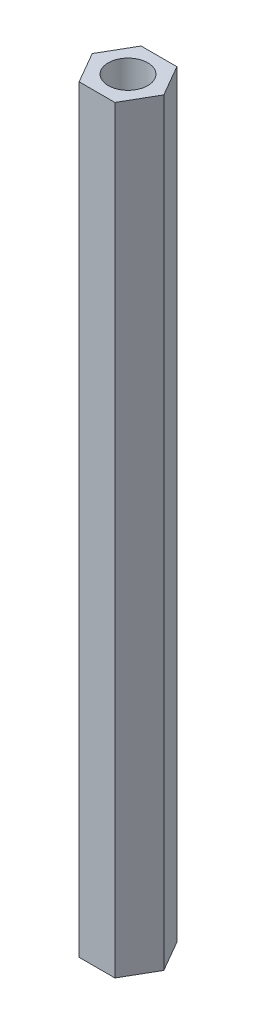
ISO-10303-21;
HEADER;
FILE_DESCRIPTION(('STEP AP214'),'2;1');
FILE_NAME('part.step','',(''),(''),'','','');
FILE_SCHEMA(('AUTOMOTIVE_DESIGN { 1 0 10303 214 1 1 1 1 }'));
ENDSEC;
DATA;
#1=APPLICATION_CONTEXT('core data for automotive mechanical design processes');
#2=APPLICATION_PROTOCOL_DEFINITION('international standard','automotive_design',2000,#1);
#3=PRODUCT_CONTEXT('',#1,'mechanical');
#4=PRODUCT('Part','Part','',(#3));
#5=PRODUCT_RELATED_PRODUCT_CATEGORY('part','',(#4));
#6=PRODUCT_DEFINITION_FORMATION('','',#4);
#7=PRODUCT_DEFINITION_CONTEXT('part definition',#1,'design');
#8=PRODUCT_DEFINITION('design','',#6,#7);
#9=PRODUCT_DEFINITION_SHAPE('','',#8);
#10=(LENGTH_UNIT() NAMED_UNIT(*) SI_UNIT(.MILLI.,.METRE.));
#11=(NAMED_UNIT(*) PLANE_ANGLE_UNIT() SI_UNIT($,.RADIAN.));
#12=(NAMED_UNIT(*) SI_UNIT($,.STERADIAN.) SOLID_ANGLE_UNIT());
#13=UNCERTAINTY_MEASURE_WITH_UNIT(LENGTH_MEASURE(1.E-05),#10,'distance_accuracy_value','');
#14=(GEOMETRIC_REPRESENTATION_CONTEXT(3) GLOBAL_UNCERTAINTY_ASSIGNED_CONTEXT((#13)) GLOBAL_UNIT_ASSIGNED_CONTEXT((#10,
#11,#12)) REPRESENTATION_CONTEXT('',''));
#15=CARTESIAN_POINT('',(0.,0.,0.));
#16=DIRECTION('',(0.,0.,1.));
#17=DIRECTION('',(1.,0.,0.));
#18=AXIS2_PLACEMENT_3D('',#15,#16,#17);
#19=CARTESIAN_POINT('',(0.,57.5,0.));
#20=DIRECTION('',(0.,1.,0.));
#21=DIRECTION('',(0.,0.,1.));
#22=AXIS2_PLACEMENT_3D('',#19,#20,#21);
#23=PLANE('',#22);
#24=DIRECTION('',(0.499999999999985,0.,-0.866025403784447));
#25=VECTOR('',#24,1.);
#26=CARTESIAN_POINT('',(1.35677313259566,57.5,2.35000000000002));
#27=LINE('',#26,#25);
#28=CARTESIAN_POINT('',(1.35677313259566,57.5,2.35000000000002));
#29=VERTEX_POINT('',#28);
#30=CARTESIAN_POINT('',(2.71354626519124,57.5,0.));
#31=VERTEX_POINT('',#30);
#32=EDGE_CURVE('E128',#29,#31,#27,.T.);
#33=ORIENTED_EDGE('',*,*,#32,.T.);
#34=DIRECTION('',(-0.500000000000015,0.,-0.86602540378443));
#35=VECTOR('',#34,1.);
#36=CARTESIAN_POINT('',(2.71354626519124,57.5,0.));
#37=LINE('',#36,#35);
#38=CARTESIAN_POINT('',(1.35677313259558,57.5,-2.34999999999998));
#39=VERTEX_POINT('',#38);
#40=EDGE_CURVE('E86',#31,#39,#37,.T.);
#41=ORIENTED_EDGE('',*,*,#40,.T.);
#42=DIRECTION('',(-1.,0.,0.));
#43=VECTOR('',#42,1.);
#44=CARTESIAN_POINT('',(1.35677313259558,57.5,-2.34999999999998));
#45=LINE('',#44,#43);
#46=CARTESIAN_POINT('',(-1.35677313259566,57.5,-2.34999999999994));
#47=VERTEX_POINT('',#46);
#48=EDGE_CURVE('E99',#39,#47,#45,.T.);
#49=ORIENTED_EDGE('',*,*,#48,.T.);
#50=DIRECTION('',(-0.499999999999985,0.,0.866025403784447));
#51=VECTOR('',#50,1.);
#52=CARTESIAN_POINT('',(-1.35677313259566,57.5,-2.34999999999994));
#53=LINE('',#52,#51);
#54=CARTESIAN_POINT('',(-2.71354626519124,57.5,0.));
#55=VERTEX_POINT('',#54);
#56=EDGE_CURVE('E93',#47,#55,#53,.T.);
#57=ORIENTED_EDGE('',*,*,#56,.T.);
#58=DIRECTION('',(0.500000000000015,0.,0.86602540378443));
#59=VECTOR('',#58,1.);
#60=CARTESIAN_POINT('',(-2.71354626519124,57.5,0.));
#61=LINE('',#60,#59);
#62=CARTESIAN_POINT('',(-1.35677313259558,57.5,2.35000000000006));
#63=VERTEX_POINT('',#62);
#64=EDGE_CURVE('E97',#55,#63,#61,.T.);
#65=ORIENTED_EDGE('',*,*,#64,.T.);
#66=DIRECTION('',(1.,0.,0.));
#67=VECTOR('',#66,1.);
#68=CARTESIAN_POINT('',(-1.35677313259558,57.5,2.35000000000006));
#69=LINE('',#68,#67);
#70=EDGE_CURVE('E49',#63,#29,#69,.T.);
#71=ORIENTED_EDGE('',*,*,#70,.T.);
#72=EDGE_LOOP('',(#33,#41,#49,#57,#65,#71));
#73=FACE_BOUND('',#72,.T.);
#74=CARTESIAN_POINT('',(0.,57.5,0.));
#75=DIRECTION('',(0.,1.,0.));
#76=DIRECTION('',(0.,0.,1.));
#77=AXIS2_PLACEMENT_3D('',#74,#75,#76);
#78=CIRCLE('',#77,1.5);
#79=CARTESIAN_POINT('',(0.,57.5,1.5));
#80=VERTEX_POINT('',#79);
#81=EDGE_CURVE('E121',#80,#80,#78,.T.);
#82=ORIENTED_EDGE('',*,*,#81,.F.);
#83=EDGE_LOOP('',(#82));
#84=FACE_BOUND('',#83,.T.);
#85=ADVANCED_FACE('F32',(#73,#84),#23,.T.);
#86=CARTESIAN_POINT('',(0.,0.,0.));
#87=DIRECTION('',(0.,1.,0.));
#88=DIRECTION('',(0.,0.,1.));
#89=AXIS2_PLACEMENT_3D('',#86,#87,#88);
#90=PLANE('',#89);
#91=DIRECTION('',(0.499999999999985,0.,-0.866025403784447));
#92=VECTOR('',#91,1.);
#93=CARTESIAN_POINT('',(1.35677313259566,0.,2.35000000000002));
#94=LINE('',#93,#92);
#95=CARTESIAN_POINT('',(1.35677313259566,0.,2.35000000000002));
#96=VERTEX_POINT('',#95);
#97=CARTESIAN_POINT('',(2.71354626519124,0.,0.));
#98=VERTEX_POINT('',#97);
#99=EDGE_CURVE('E117',#96,#98,#94,.T.);
#100=ORIENTED_EDGE('',*,*,#99,.F.);
#101=DIRECTION('',(1.,0.,0.));
#102=VECTOR('',#101,1.);
#103=CARTESIAN_POINT('',(-1.35677313259558,0.,2.35000000000006));
#104=LINE('',#103,#102);
#105=CARTESIAN_POINT('',(-1.35677313259558,0.,2.35000000000006));
#106=VERTEX_POINT('',#105);
#107=EDGE_CURVE('E78',#106,#96,#104,.T.);
#108=ORIENTED_EDGE('',*,*,#107,.F.);
#109=DIRECTION('',(0.500000000000015,0.,0.86602540378443));
#110=VECTOR('',#109,1.);
#111=CARTESIAN_POINT('',(-2.71354626519124,0.,0.));
#112=LINE('',#111,#110);
#113=CARTESIAN_POINT('',(-2.71354626519124,0.,0.));
#114=VERTEX_POINT('',#113);
#115=EDGE_CURVE('E72',#114,#106,#112,.T.);
#116=ORIENTED_EDGE('',*,*,#115,.F.);
#117=DIRECTION('',(-0.499999999999985,0.,0.866025403784447));
#118=VECTOR('',#117,1.);
#119=CARTESIAN_POINT('',(-1.35677313259566,0.,-2.34999999999994));
#120=LINE('',#119,#118);
#121=CARTESIAN_POINT('',(-1.35677313259566,0.,-2.34999999999994));
#122=VERTEX_POINT('',#121);
#123=EDGE_CURVE('E107',#122,#114,#120,.T.);
#124=ORIENTED_EDGE('',*,*,#123,.F.);
#125=DIRECTION('',(-1.,0.,0.));
#126=VECTOR('',#125,1.);
#127=CARTESIAN_POINT('',(1.35677313259558,0.,-2.34999999999998));
#128=LINE('',#127,#126);
#129=CARTESIAN_POINT('',(1.35677313259558,0.,-2.34999999999998));
#130=VERTEX_POINT('',#129);
#131=EDGE_CURVE('E123',#130,#122,#128,.T.);
#132=ORIENTED_EDGE('',*,*,#131,.F.);
#133=DIRECTION('',(-0.500000000000015,0.,-0.86602540378443));
#134=VECTOR('',#133,1.);
#135=CARTESIAN_POINT('',(2.71354626519124,0.,0.));
#136=LINE('',#135,#134);
#137=EDGE_CURVE('E120',#98,#130,#136,.T.);
#138=ORIENTED_EDGE('',*,*,#137,.F.);
#139=EDGE_LOOP('',(#100,#108,#116,#124,#132,#138));
#140=FACE_BOUND('',#139,.T.);
#141=CARTESIAN_POINT('',(0.,0.,0.));
#142=DIRECTION('',(0.,1.,0.));
#143=DIRECTION('',(0.,0.,1.));
#144=AXIS2_PLACEMENT_3D('',#141,#142,#143);
#145=CIRCLE('',#144,1.5);
#146=CARTESIAN_POINT('',(0.,0.,1.5));
#147=VERTEX_POINT('',#146);
#148=EDGE_CURVE('E221',#147,#147,#145,.T.);
#149=ORIENTED_EDGE('',*,*,#148,.T.);
#150=EDGE_LOOP('',(#149));
#151=FACE_BOUND('',#150,.T.);
#152=ADVANCED_FACE('F137',(#140,#151),#90,.F.);
#153=CARTESIAN_POINT('',(1.35677313259566,57.5,2.35000000000002));
#154=DIRECTION('',(-0.866025403784447,0.,-0.499999999999985));
#155=DIRECTION('',(-0.499999999999985,0.,0.866025403784447));
#156=AXIS2_PLACEMENT_3D('',#153,#154,#155);
#157=PLANE('',#156);
#158=ORIENTED_EDGE('',*,*,#99,.T.);
#159=DIRECTION('',(0.,-1.,0.));
#160=VECTOR('',#159,1.);
#161=CARTESIAN_POINT('',(2.71354626519124,57.5,0.));
#162=LINE('',#161,#160);
#163=EDGE_CURVE('E11',#31,#98,#162,.T.);
#164=ORIENTED_EDGE('',*,*,#163,.F.);
#165=ORIENTED_EDGE('',*,*,#32,.F.);
#166=DIRECTION('',(0.,-1.,0.));
#167=VECTOR('',#166,1.);
#168=CARTESIAN_POINT('',(1.35677313259566,57.5,2.35000000000002));
#169=LINE('',#168,#167);
#170=EDGE_CURVE('E113',#29,#96,#169,.T.);
#171=ORIENTED_EDGE('',*,*,#170,.T.);
#172=EDGE_LOOP('',(#158,#164,#165,#171));
#173=FACE_BOUND('',#172,.T.);
#174=ADVANCED_FACE('F34',(#173),#157,.F.);
#175=CARTESIAN_POINT('',(2.71354626519124,57.5,0.));
#176=DIRECTION('',(-0.86602540378443,0.,0.500000000000015));
#177=DIRECTION('',(0.500000000000015,0.,0.86602540378443));
#178=AXIS2_PLACEMENT_3D('',#175,#176,#177);
#179=PLANE('',#178);
#180=ORIENTED_EDGE('',*,*,#137,.T.);
#181=DIRECTION('',(0.,-1.,0.));
#182=VECTOR('',#181,1.);
#183=CARTESIAN_POINT('',(1.35677313259558,57.5,-2.34999999999998));
#184=LINE('',#183,#182);
#185=EDGE_CURVE('E41',#39,#130,#184,.T.);
#186=ORIENTED_EDGE('',*,*,#185,.F.);
#187=ORIENTED_EDGE('',*,*,#40,.F.);
#188=ORIENTED_EDGE('',*,*,#163,.T.);
#189=EDGE_LOOP('',(#180,#186,#187,#188));
#190=FACE_BOUND('',#189,.T.);
#191=ADVANCED_FACE('F162',(#190),#179,.F.);
#192=CARTESIAN_POINT('',(1.35677313259558,57.5,-2.34999999999998));
#193=DIRECTION('',(0.,0.,1.));
#194=DIRECTION('',(1.,0.,0.));
#195=AXIS2_PLACEMENT_3D('',#192,#193,#194);
#196=PLANE('',#195);
#197=ORIENTED_EDGE('',*,*,#131,.T.);
#198=DIRECTION('',(0.,-1.,0.));
#199=VECTOR('',#198,1.);
#200=CARTESIAN_POINT('',(-1.35677313259566,57.5,-2.34999999999994));
#201=LINE('',#200,#199);
#202=EDGE_CURVE('E108',#47,#122,#201,.T.);
#203=ORIENTED_EDGE('',*,*,#202,.F.);
#204=ORIENTED_EDGE('',*,*,#48,.F.);
#205=ORIENTED_EDGE('',*,*,#185,.T.);
#206=EDGE_LOOP('',(#197,#203,#204,#205));
#207=FACE_BOUND('',#206,.T.);
#208=ADVANCED_FACE('F134',(#207),#196,.F.);
#209=CARTESIAN_POINT('',(-1.35677313259566,57.5,-2.34999999999994));
#210=DIRECTION('',(0.866025403784447,0.,0.499999999999985));
#211=DIRECTION('',(0.499999999999985,0.,-0.866025403784447));
#212=AXIS2_PLACEMENT_3D('',#209,#210,#211);
#213=PLANE('',#212);
#214=ORIENTED_EDGE('',*,*,#123,.T.);
#215=DIRECTION('',(0.,-1.,0.));
#216=VECTOR('',#215,1.);
#217=CARTESIAN_POINT('',(-2.71354626519124,57.5,0.));
#218=LINE('',#217,#216);
#219=EDGE_CURVE('E104',#55,#114,#218,.T.);
#220=ORIENTED_EDGE('',*,*,#219,.F.);
#221=ORIENTED_EDGE('',*,*,#56,.F.);
#222=ORIENTED_EDGE('',*,*,#202,.T.);
#223=EDGE_LOOP('',(#214,#220,#221,#222));
#224=FACE_BOUND('',#223,.T.);
#225=ADVANCED_FACE('F105',(#224),#213,.F.);
#226=CARTESIAN_POINT('',(-2.71354626519124,57.5,0.));
#227=DIRECTION('',(0.86602540378443,0.,-0.500000000000015));
#228=DIRECTION('',(-0.500000000000015,0.,-0.86602540378443));
#229=AXIS2_PLACEMENT_3D('',#226,#227,#228);
#230=PLANE('',#229);
#231=ORIENTED_EDGE('',*,*,#115,.T.);
#232=DIRECTION('',(0.,-1.,0.));
#233=VECTOR('',#232,1.);
#234=CARTESIAN_POINT('',(-1.35677313259558,57.5,2.35000000000006));
#235=LINE('',#234,#233);
#236=EDGE_CURVE('E109',#63,#106,#235,.T.);
#237=ORIENTED_EDGE('',*,*,#236,.F.);
#238=ORIENTED_EDGE('',*,*,#64,.F.);
#239=ORIENTED_EDGE('',*,*,#219,.T.);
#240=EDGE_LOOP('',(#231,#237,#238,#239));
#241=FACE_BOUND('',#240,.T.);
#242=ADVANCED_FACE('F111',(#241),#230,.F.);
#243=CARTESIAN_POINT('',(-1.35677313259558,57.5,2.35000000000006));
#244=DIRECTION('',(0.,0.,-1.));
#245=DIRECTION('',(-1.,0.,0.));
#246=AXIS2_PLACEMENT_3D('',#243,#244,#245);
#247=PLANE('',#246);
#248=ORIENTED_EDGE('',*,*,#107,.T.);
#249=ORIENTED_EDGE('',*,*,#170,.F.);
#250=ORIENTED_EDGE('',*,*,#70,.F.);
#251=ORIENTED_EDGE('',*,*,#236,.T.);
#252=EDGE_LOOP('',(#248,#249,#250,#251));
#253=FACE_BOUND('',#252,.T.);
#254=ADVANCED_FACE('F142',(#253),#247,.F.);
#255=CARTESIAN_POINT('',(0.,57.5,0.));
#256=DIRECTION('',(0.,-1.,0.));
#257=DIRECTION('',(0.,0.,-1.));
#258=AXIS2_PLACEMENT_3D('',#255,#256,#257);
#259=CYLINDRICAL_SURFACE('',#258,1.5);
#260=ORIENTED_EDGE('',*,*,#81,.T.);
#261=EDGE_LOOP('',(#260));
#262=FACE_BOUND('',#261,.T.);
#263=ORIENTED_EDGE('',*,*,#148,.F.);
#264=EDGE_LOOP('',(#263));
#265=FACE_BOUND('',#264,.T.);
#266=ADVANCED_FACE('F144',(#262,#265),#259,.F.);
#267=CLOSED_SHELL('',(#85,#152,#174,#191,#208,#225,#242,#254,#266));
#268=MANIFOLD_SOLID_BREP('B2',#267);
#269=ADVANCED_BREP_SHAPE_REPRESENTATION('',(#18,#268),#14);
#270=SHAPE_DEFINITION_REPRESENTATION(#9,#269);
ENDSEC;
END-ISO-10303-21;
